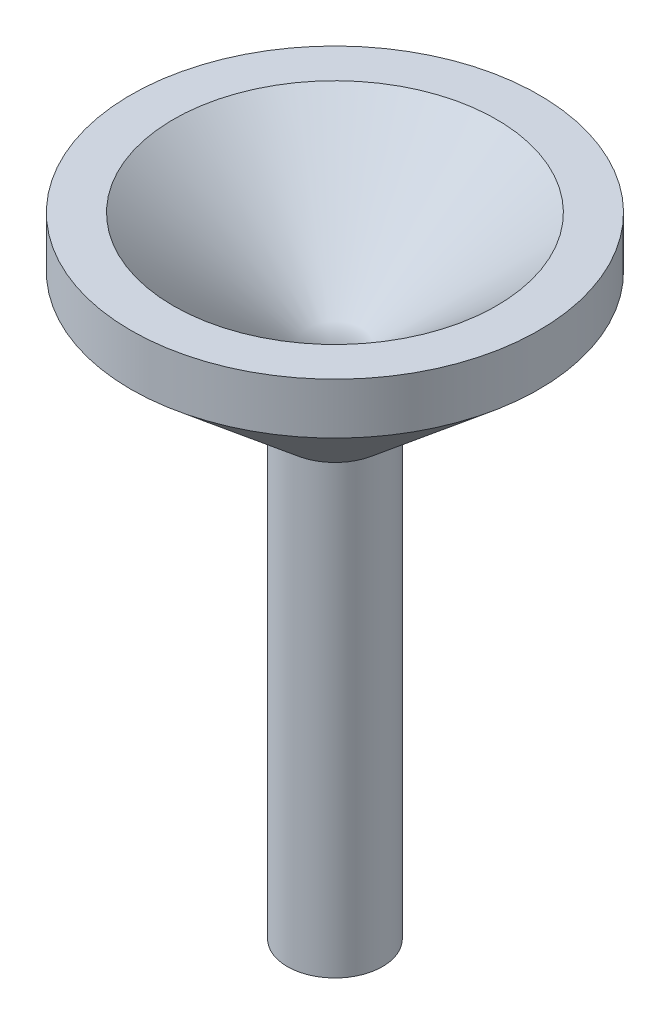
ISO-10303-21;
HEADER;
FILE_DESCRIPTION(('STEP AP214'),'2;1');
FILE_NAME('part.step','',(''),(''),'','','');
FILE_SCHEMA(('AUTOMOTIVE_DESIGN { 1 0 10303 214 1 1 1 1 }'));
ENDSEC;
DATA;
#1=APPLICATION_CONTEXT('core data for automotive mechanical design processes');
#2=APPLICATION_PROTOCOL_DEFINITION('international standard','automotive_design',2000,#1);
#3=PRODUCT_CONTEXT('',#1,'mechanical');
#4=PRODUCT('Part','Part','',(#3));
#5=PRODUCT_RELATED_PRODUCT_CATEGORY('part','',(#4));
#6=PRODUCT_DEFINITION_FORMATION('','',#4);
#7=PRODUCT_DEFINITION_CONTEXT('part definition',#1,'design');
#8=PRODUCT_DEFINITION('design','',#6,#7);
#9=PRODUCT_DEFINITION_SHAPE('','',#8);
#10=(LENGTH_UNIT() NAMED_UNIT(*) SI_UNIT(.MILLI.,.METRE.));
#11=(NAMED_UNIT(*) PLANE_ANGLE_UNIT() SI_UNIT($,.RADIAN.));
#12=(NAMED_UNIT(*) SI_UNIT($,.STERADIAN.) SOLID_ANGLE_UNIT());
#13=UNCERTAINTY_MEASURE_WITH_UNIT(LENGTH_MEASURE(1.E-05),#10,'distance_accuracy_value','');
#14=(GEOMETRIC_REPRESENTATION_CONTEXT(3) GLOBAL_UNCERTAINTY_ASSIGNED_CONTEXT((#13)) GLOBAL_UNIT_ASSIGNED_CONTEXT((#10,
#11,#12)) REPRESENTATION_CONTEXT('',''));
#15=CARTESIAN_POINT('',(0.,0.,0.));
#16=DIRECTION('',(0.,0.,1.));
#17=DIRECTION('',(1.,0.,0.));
#18=AXIS2_PLACEMENT_3D('',#15,#16,#17);
#19=CARTESIAN_POINT('',(0.,80.,0.));
#20=DIRECTION('',(0.,1.,0.));
#21=DIRECTION('',(0.,0.,1.));
#22=AXIS2_PLACEMENT_3D('',#19,#20,#21);
#23=CONICAL_SURFACE('',#22,95.,0.870903457075653);
#24=CARTESIAN_POINT('',(0.,0.,0.));
#25=VERTEX_POINT('',#24);
#26=VERTEX_LOOP('',#25);
#27=FACE_BOUND('',#26,.T.);
#28=CARTESIAN_POINT('',(0.,80.,0.));
#29=DIRECTION('',(0.,1.,0.));
#30=DIRECTION('',(0.,0.,1.));
#31=AXIS2_PLACEMENT_3D('',#28,#29,#30);
#32=CIRCLE('',#31,95.);
#33=CARTESIAN_POINT('',(0.,80.,95.));
#34=VERTEX_POINT('',#33);
#35=EDGE_CURVE('E11',#34,#34,#32,.T.);
#36=ORIENTED_EDGE('',*,*,#35,.T.);
#37=EDGE_LOOP('',(#36));
#38=FACE_BOUND('',#37,.T.);
#39=ADVANCED_FACE('F33',(#27,#38),#23,.F.);
#40=CARTESIAN_POINT('',(95.,80.,0.));
#41=DIRECTION('',(0.,-1.,0.));
#42=DIRECTION('',(0.,0.,-1.));
#43=AXIS2_PLACEMENT_3D('',#40,#41,#42);
#44=PLANE('',#43);
#45=ORIENTED_EDGE('',*,*,#35,.F.);
#46=EDGE_LOOP('',(#45));
#47=FACE_BOUND('',#46,.T.);
#48=CARTESIAN_POINT('',(0.,80.,0.));
#49=DIRECTION('',(0.,1.,0.));
#50=DIRECTION('',(0.,0.,1.));
#51=AXIS2_PLACEMENT_3D('',#48,#49,#50);
#52=CIRCLE('',#51,120.);
#53=CARTESIAN_POINT('',(0.,80.,120.));
#54=VERTEX_POINT('',#53);
#55=EDGE_CURVE('E39',#54,#54,#52,.T.);
#56=ORIENTED_EDGE('',*,*,#55,.T.);
#57=EDGE_LOOP('',(#56));
#58=FACE_BOUND('',#57,.T.);
#59=ADVANCED_FACE('F44',(#47,#58),#44,.F.);
#60=CARTESIAN_POINT('',(0.,178.391999298056,0.));
#61=DIRECTION('',(0.,1.,0.));
#62=DIRECTION('',(0.,0.,1.));
#63=AXIS2_PLACEMENT_3D('',#60,#61,#62);
#64=CYLINDRICAL_SURFACE('',#63,120.);
#65=ORIENTED_EDGE('',*,*,#55,.F.);
#66=EDGE_LOOP('',(#65));
#67=FACE_BOUND('',#66,.T.);
#68=CARTESIAN_POINT('',(0.,50.,0.));
#69=DIRECTION('',(0.,1.,0.));
#70=DIRECTION('',(0.,0.,1.));
#71=AXIS2_PLACEMENT_3D('',#68,#69,#70);
#72=CIRCLE('',#71,120.);
#73=CARTESIAN_POINT('',(0.,50.,120.));
#74=VERTEX_POINT('',#73);
#75=EDGE_CURVE('E53',#74,#74,#72,.T.);
#76=ORIENTED_EDGE('',*,*,#75,.T.);
#77=EDGE_LOOP('',(#76));
#78=FACE_BOUND('',#77,.T.);
#79=ADVANCED_FACE('F49',(#67,#78),#64,.T.);
#80=CARTESIAN_POINT('',(0.,-27.4736842105263,0.));
#81=DIRECTION('',(0.,1.,0.));
#82=DIRECTION('',(0.,0.,1.));
#83=AXIS2_PLACEMENT_3D('',#80,#81,#82);
#84=CONICAL_SURFACE('',#83,28.,0.870903457075653);
#85=ORIENTED_EDGE('',*,*,#75,.F.);
#86=EDGE_LOOP('',(#85));
#87=FACE_BOUND('',#86,.T.);
#88=CARTESIAN_POINT('',(0.,-27.4736842105263,0.));
#89=DIRECTION('',(0.,1.,0.));
#90=DIRECTION('',(0.,0.,1.));
#91=AXIS2_PLACEMENT_3D('',#88,#89,#90);
#92=CIRCLE('',#91,28.);
#93=CARTESIAN_POINT('',(0.,-27.4736842105263,28.));
#94=VERTEX_POINT('',#93);
#95=EDGE_CURVE('E55',#94,#94,#92,.T.);
#96=ORIENTED_EDGE('',*,*,#95,.T.);
#97=EDGE_LOOP('',(#96));
#98=FACE_BOUND('',#97,.T.);
#99=ADVANCED_FACE('F72',(#87,#98),#84,.T.);
#100=CARTESIAN_POINT('',(0.,178.391999298056,0.));
#101=DIRECTION('',(0.,1.,0.));
#102=DIRECTION('',(0.,0.,1.));
#103=AXIS2_PLACEMENT_3D('',#100,#101,#102);
#104=CYLINDRICAL_SURFACE('',#103,28.);
#105=ORIENTED_EDGE('',*,*,#95,.F.);
#106=EDGE_LOOP('',(#105));
#107=FACE_BOUND('',#106,.T.);
#108=CARTESIAN_POINT('',(0.,-290.,0.));
#109=DIRECTION('',(0.,1.,0.));
#110=DIRECTION('',(0.,0.,1.));
#111=AXIS2_PLACEMENT_3D('',#108,#109,#110);
#112=CIRCLE('',#111,28.0000000000001);
#113=CARTESIAN_POINT('',(0.,-290.,28.0000000000001));
#114=VERTEX_POINT('',#113);
#115=EDGE_CURVE('E60',#114,#114,#112,.T.);
#116=ORIENTED_EDGE('',*,*,#115,.T.);
#117=EDGE_LOOP('',(#116));
#118=FACE_BOUND('',#117,.T.);
#119=ADVANCED_FACE('F64',(#107,#118),#104,.T.);
#120=CARTESIAN_POINT('',(28.0000000000001,-290.,0.));
#121=DIRECTION('',(0.,1.,0.));
#122=DIRECTION('',(0.,0.,1.));
#123=AXIS2_PLACEMENT_3D('',#120,#121,#122);
#124=PLANE('',#123);
#125=ORIENTED_EDGE('',*,*,#115,.F.);
#126=EDGE_LOOP('',(#125));
#127=FACE_BOUND('',#126,.T.);
#128=ADVANCED_FACE('F66',(#127),#124,.F.);
#129=CLOSED_SHELL('',(#39,#59,#79,#99,#119,#128));
#130=MANIFOLD_SOLID_BREP('B2',#129);
#131=ADVANCED_BREP_SHAPE_REPRESENTATION('',(#18,#130),#14);
#132=SHAPE_DEFINITION_REPRESENTATION(#9,#131);
ENDSEC;
END-ISO-10303-21;
